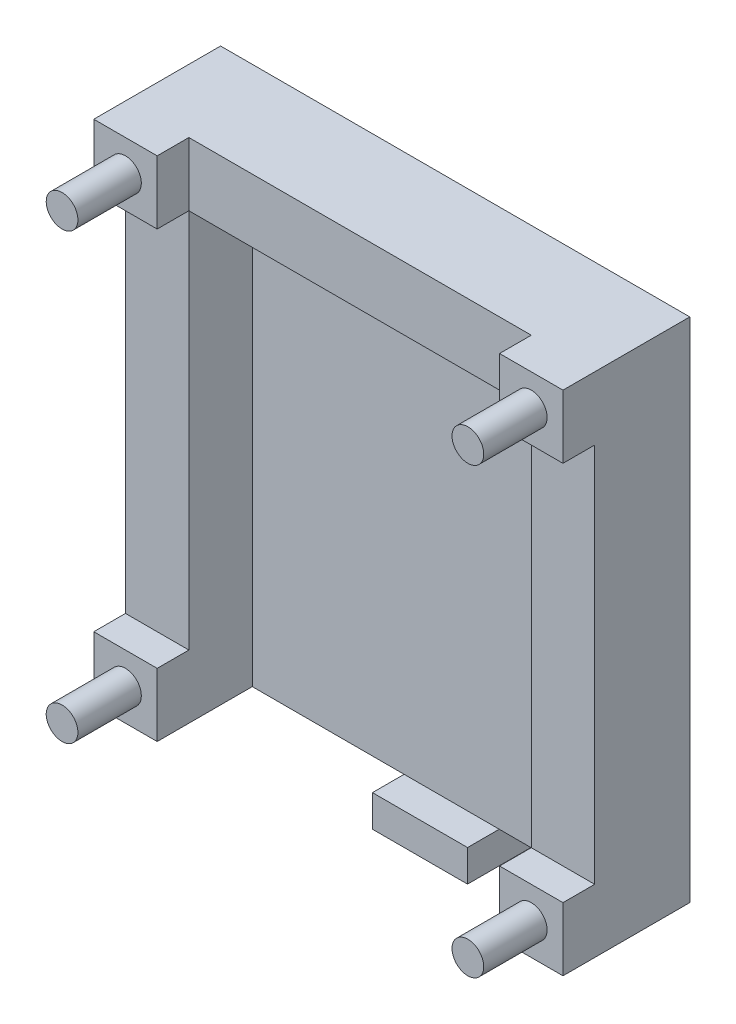
ISO-10303-21;
HEADER;
FILE_DESCRIPTION(('STEP AP214'),'2;1');
FILE_NAME('part.step','',(''),(''),'','','');
FILE_SCHEMA(('AUTOMOTIVE_DESIGN { 1 0 10303 214 1 1 1 1 }'));
ENDSEC;
DATA;
#1=APPLICATION_CONTEXT('core data for automotive mechanical design processes');
#2=APPLICATION_PROTOCOL_DEFINITION('international standard','automotive_design',2000,#1);
#3=PRODUCT_CONTEXT('',#1,'mechanical');
#4=PRODUCT('Part','Part','',(#3));
#5=PRODUCT_RELATED_PRODUCT_CATEGORY('part','',(#4));
#6=PRODUCT_DEFINITION_FORMATION('','',#4);
#7=PRODUCT_DEFINITION_CONTEXT('part definition',#1,'design');
#8=PRODUCT_DEFINITION('design','',#6,#7);
#9=PRODUCT_DEFINITION_SHAPE('','',#8);
#10=(LENGTH_UNIT() NAMED_UNIT(*) SI_UNIT(.MILLI.,.METRE.));
#11=(NAMED_UNIT(*) PLANE_ANGLE_UNIT() SI_UNIT($,.RADIAN.));
#12=(NAMED_UNIT(*) SI_UNIT($,.STERADIAN.) SOLID_ANGLE_UNIT());
#13=UNCERTAINTY_MEASURE_WITH_UNIT(LENGTH_MEASURE(1.E-05),#10,'distance_accuracy_value','');
#14=(GEOMETRIC_REPRESENTATION_CONTEXT(3) GLOBAL_UNCERTAINTY_ASSIGNED_CONTEXT((#13)) GLOBAL_UNIT_ASSIGNED_CONTEXT((#10,
#11,#12)) REPRESENTATION_CONTEXT('',''));
#15=CARTESIAN_POINT('',(0.,0.,0.));
#16=DIRECTION('',(0.,0.,1.));
#17=DIRECTION('',(1.,0.,0.));
#18=AXIS2_PLACEMENT_3D('',#15,#16,#17);
#19=CARTESIAN_POINT('',(0.,-38.4913625304137,10.));
#20=DIRECTION('',(0.,1.,0.));
#21=DIRECTION('',(-1.,0.,0.));
#22=AXIS2_PLACEMENT_3D('',#19,#20,#21);
#23=PLANE('',#22);
#24=DIRECTION('',(1.,0.,0.));
#25=VECTOR('',#24,1.);
#26=CARTESIAN_POINT('',(0.,-38.4913625304137,0.));
#27=LINE('',#26,#25);
#28=CARTESIAN_POINT('',(25.3489672837016,-38.4913625304136,0.));
#29=VERTEX_POINT('',#28);
#30=CARTESIAN_POINT('',(40.3489672837016,-38.4913625304136,0.));
#31=VERTEX_POINT('',#30);
#32=EDGE_CURVE('E110',#29,#31,#27,.T.);
#33=ORIENTED_EDGE('',*,*,#32,.T.);
#34=DIRECTION('',(0.,0.,-1.));
#35=VECTOR('',#34,1.);
#36=CARTESIAN_POINT('',(40.3489672837016,-38.4913625304136,10.));
#37=LINE('',#36,#35);
#38=CARTESIAN_POINT('',(40.3489672837016,-38.4913625304136,10.));
#39=VERTEX_POINT('',#38);
#40=EDGE_CURVE('E13',#39,#31,#37,.T.);
#41=ORIENTED_EDGE('',*,*,#40,.F.);
#42=DIRECTION('',(1.,0.,0.));
#43=VECTOR('',#42,1.);
#44=CARTESIAN_POINT('',(0.,-38.4913625304137,10.));
#45=LINE('',#44,#43);
#46=CARTESIAN_POINT('',(25.3489672837016,-38.4913625304136,10.));
#47=VERTEX_POINT('',#46);
#48=EDGE_CURVE('E105',#47,#39,#45,.T.);
#49=ORIENTED_EDGE('',*,*,#48,.F.);
#50=DIRECTION('',(0.,0.,-1.));
#51=VECTOR('',#50,1.);
#52=CARTESIAN_POINT('',(25.3489672837016,-38.4913625304136,10.));
#53=LINE('',#52,#51);
#54=EDGE_CURVE('E49',#47,#29,#53,.T.);
#55=ORIENTED_EDGE('',*,*,#54,.T.);
#56=EDGE_LOOP('',(#33,#41,#49,#55));
#57=FACE_BOUND('',#56,.T.);
#58=ADVANCED_FACE('F46',(#57),#23,.F.);
#59=CARTESIAN_POINT('',(40.3489672837016,0.,10.));
#60=DIRECTION('',(-1.,0.,0.));
#61=DIRECTION('',(0.,0.,1.));
#62=AXIS2_PLACEMENT_3D('',#59,#60,#61);
#63=PLANE('',#62);
#64=DIRECTION('',(0.,1.,0.));
#65=VECTOR('',#64,1.);
#66=CARTESIAN_POINT('',(40.3489672837016,0.,0.));
#67=LINE('',#66,#65);
#68=CARTESIAN_POINT('',(40.3489672837016,-33.4913625304136,0.));
#69=VERTEX_POINT('',#68);
#70=EDGE_CURVE('E77',#31,#69,#67,.T.);
#71=ORIENTED_EDGE('',*,*,#70,.T.);
#72=DIRECTION('',(0.,0.,-1.));
#73=VECTOR('',#72,1.);
#74=CARTESIAN_POINT('',(40.3489672837016,-33.4913625304136,10.));
#75=LINE('',#74,#73);
#76=CARTESIAN_POINT('',(40.3489672837016,-33.4913625304136,10.));
#77=VERTEX_POINT('',#76);
#78=EDGE_CURVE('E55',#77,#69,#75,.T.);
#79=ORIENTED_EDGE('',*,*,#78,.F.);
#80=DIRECTION('',(0.,1.,0.));
#81=VECTOR('',#80,1.);
#82=CARTESIAN_POINT('',(40.3489672837016,0.,10.));
#83=LINE('',#82,#81);
#84=EDGE_CURVE('E63',#39,#77,#83,.T.);
#85=ORIENTED_EDGE('',*,*,#84,.F.);
#86=ORIENTED_EDGE('',*,*,#40,.T.);
#87=EDGE_LOOP('',(#71,#79,#85,#86));
#88=FACE_BOUND('',#87,.T.);
#89=ADVANCED_FACE('F120',(#88),#63,.F.);
#90=CARTESIAN_POINT('',(0.,-33.4913625304136,10.));
#91=DIRECTION('',(0.,-1.,0.));
#92=DIRECTION('',(1.,0.,0.));
#93=AXIS2_PLACEMENT_3D('',#90,#91,#92);
#94=PLANE('',#93);
#95=DIRECTION('',(-1.,0.,0.));
#96=VECTOR('',#95,1.);
#97=CARTESIAN_POINT('',(0.,-33.4913625304136,0.));
#98=LINE('',#97,#96);
#99=CARTESIAN_POINT('',(25.3489672837016,-33.4913625304136,0.));
#100=VERTEX_POINT('',#99);
#101=EDGE_CURVE('E99',#69,#100,#98,.T.);
#102=ORIENTED_EDGE('',*,*,#101,.T.);
#103=DIRECTION('',(0.,0.,-1.));
#104=VECTOR('',#103,1.);
#105=CARTESIAN_POINT('',(25.3489672837016,-33.4913625304136,10.));
#106=LINE('',#105,#104);
#107=CARTESIAN_POINT('',(25.3489672837016,-33.4913625304136,10.));
#108=VERTEX_POINT('',#107);
#109=EDGE_CURVE('E97',#108,#100,#106,.T.);
#110=ORIENTED_EDGE('',*,*,#109,.F.);
#111=DIRECTION('',(-1.,0.,0.));
#112=VECTOR('',#111,1.);
#113=CARTESIAN_POINT('',(0.,-33.4913625304136,10.));
#114=LINE('',#113,#112);
#115=EDGE_CURVE('E91',#77,#108,#114,.T.);
#116=ORIENTED_EDGE('',*,*,#115,.F.);
#117=ORIENTED_EDGE('',*,*,#78,.T.);
#118=EDGE_LOOP('',(#102,#110,#116,#117));
#119=FACE_BOUND('',#118,.T.);
#120=ADVANCED_FACE('F98',(#119),#94,.F.);
#121=CARTESIAN_POINT('',(25.3489672837016,0.,10.));
#122=DIRECTION('',(1.,0.,0.));
#123=DIRECTION('',(0.,0.,-1.));
#124=AXIS2_PLACEMENT_3D('',#121,#122,#123);
#125=PLANE('',#124);
#126=DIRECTION('',(0.,-1.,0.));
#127=VECTOR('',#126,1.);
#128=CARTESIAN_POINT('',(25.3489672837016,0.,0.));
#129=LINE('',#128,#127);
#130=EDGE_CURVE('E113',#100,#29,#129,.T.);
#131=ORIENTED_EDGE('',*,*,#130,.T.);
#132=ORIENTED_EDGE('',*,*,#54,.F.);
#133=DIRECTION('',(0.,-1.,0.));
#134=VECTOR('',#133,1.);
#135=CARTESIAN_POINT('',(25.3489672837016,0.,10.));
#136=LINE('',#135,#134);
#137=EDGE_CURVE('E88',#108,#47,#136,.T.);
#138=ORIENTED_EDGE('',*,*,#137,.F.);
#139=ORIENTED_EDGE('',*,*,#109,.T.);
#140=EDGE_LOOP('',(#131,#132,#138,#139));
#141=FACE_BOUND('',#140,.T.);
#142=ADVANCED_FACE('F102',(#141),#125,.F.);
#143=CARTESIAN_POINT('',(0.,0.,10.));
#144=DIRECTION('',(0.,0.,-1.));
#145=DIRECTION('',(-1.,0.,0.));
#146=AXIS2_PLACEMENT_3D('',#143,#144,#145);
#147=PLANE('',#146);
#148=ORIENTED_EDGE('',*,*,#48,.T.);
#149=ORIENTED_EDGE('',*,*,#84,.T.);
#150=ORIENTED_EDGE('',*,*,#115,.T.);
#151=ORIENTED_EDGE('',*,*,#137,.T.);
#152=EDGE_LOOP('',(#148,#149,#150,#151));
#153=FACE_BOUND('',#152,.T.);
#154=ADVANCED_FACE('F93',(#153),#147,.F.);
#155=CARTESIAN_POINT('',(0.,0.,0.));
#156=DIRECTION('',(0.,0.,-1.));
#157=DIRECTION('',(-1.,0.,0.));
#158=AXIS2_PLACEMENT_3D('',#155,#156,#157);
#159=PLANE('',#158);
#160=ORIENTED_EDGE('',*,*,#32,.F.);
#161=ORIENTED_EDGE('',*,*,#130,.F.);
#162=ORIENTED_EDGE('',*,*,#101,.F.);
#163=ORIENTED_EDGE('',*,*,#70,.F.);
#164=EDGE_LOOP('',(#160,#161,#162,#163));
#165=FACE_BOUND('',#164,.T.);
#166=ADVANCED_FACE('F117',(#165),#159,.T.);
#167=CLOSED_SHELL('',(#58,#89,#120,#142,#154,#166));
#168=MANIFOLD_SOLID_BREP('B2',#167);
#169=CARTESIAN_POINT('',(0.,0.,0.));
#170=DIRECTION('',(0.,0.,-1.));
#171=DIRECTION('',(-1.,0.,0.));
#172=AXIS2_PLACEMENT_3D('',#169,#170,#171);
#173=PLANE('',#172);
#174=CARTESIAN_POINT('',(-3.59945618907709,41.5086374695864,0.));
#175=DIRECTION('',(0.,0.,-1.));
#176=DIRECTION('',(-1.,0.,0.));
#177=AXIS2_PLACEMENT_3D('',#174,#175,#176);
#178=CIRCLE('',#177,2.55);
#179=CARTESIAN_POINT('',(-6.14945618907709,41.5086374695864,0.));
#180=VERTEX_POINT('',#179);
#181=EDGE_CURVE('E562',#180,#180,#178,.F.);
#182=ORIENTED_EDGE('',*,*,#181,.T.);
#183=EDGE_LOOP('',(#182));
#184=FACE_BOUND('',#183,.T.);
#185=CARTESIAN_POINT('',(60.4005438109229,41.5086374695864,0.));
#186=DIRECTION('',(0.,0.,-1.));
#187=DIRECTION('',(-1.,0.,0.));
#188=AXIS2_PLACEMENT_3D('',#185,#186,#187);
#189=CIRCLE('',#188,2.55);
#190=CARTESIAN_POINT('',(57.8505438109229,41.5086374695864,0.));
#191=VERTEX_POINT('',#190);
#192=EDGE_CURVE('E556',#191,#191,#189,.T.);
#193=ORIENTED_EDGE('',*,*,#192,.F.);
#194=EDGE_LOOP('',(#193));
#195=FACE_BOUND('',#194,.T.);
#196=DIRECTION('',(0.,1.,0.));
#197=VECTOR('',#196,1.);
#198=CARTESIAN_POINT('',(-8.59945618907709,0.,0.));
#199=LINE('',#198,#197);
#200=CARTESIAN_POINT('',(-8.59945618907709,-33.4913625304136,0.));
#201=VERTEX_POINT('',#200);
#202=CARTESIAN_POINT('',(-8.59945618907708,46.5086374695864,0.));
#203=VERTEX_POINT('',#202);
#204=EDGE_CURVE('E334',#201,#203,#199,.T.);
#205=ORIENTED_EDGE('',*,*,#204,.T.);
#206=DIRECTION('',(1.,0.,0.));
#207=VECTOR('',#206,1.);
#208=CARTESIAN_POINT('',(55.4005438109229,46.5086374695864,0.));
#209=LINE('',#208,#207);
#210=CARTESIAN_POINT('',(65.4005438109229,46.5086374695864,0.));
#211=VERTEX_POINT('',#210);
#212=EDGE_CURVE('E397',#203,#211,#209,.T.);
#213=ORIENTED_EDGE('',*,*,#212,.T.);
#214=DIRECTION('',(0.,-1.,0.));
#215=VECTOR('',#214,1.);
#216=CARTESIAN_POINT('',(65.4005438109229,0.,0.));
#217=LINE('',#216,#215);
#218=CARTESIAN_POINT('',(65.4005438109229,-33.4913625304136,0.));
#219=VERTEX_POINT('',#218);
#220=EDGE_CURVE('E373',#211,#219,#217,.T.);
#221=ORIENTED_EDGE('',*,*,#220,.T.);
#222=DIRECTION('',(1.,0.,0.));
#223=VECTOR('',#222,1.);
#224=CARTESIAN_POINT('',(55.4005438109229,-33.4913625304136,0.));
#225=LINE('',#224,#223);
#226=EDGE_CURVE('E419',#201,#219,#225,.T.);
#227=ORIENTED_EDGE('',*,*,#226,.F.);
#228=EDGE_LOOP('',(#205,#213,#221,#227));
#229=FACE_BOUND('',#228,.T.);
#230=CARTESIAN_POINT('',(-3.59945618907709,-28.4913625304136,0.));
#231=DIRECTION('',(0.,0.,-1.));
#232=DIRECTION('',(-1.,0.,0.));
#233=AXIS2_PLACEMENT_3D('',#230,#231,#232);
#234=CIRCLE('',#233,2.55);
#235=CARTESIAN_POINT('',(-6.14945618907709,-28.4913625304136,0.));
#236=VERTEX_POINT('',#235);
#237=EDGE_CURVE('E568',#236,#236,#234,.T.);
#238=ORIENTED_EDGE('',*,*,#237,.F.);
#239=EDGE_LOOP('',(#238));
#240=FACE_BOUND('',#239,.T.);
#241=CARTESIAN_POINT('',(60.4005438109229,-28.4913625304136,0.));
#242=DIRECTION('',(0.,0.,-1.));
#243=DIRECTION('',(-1.,0.,0.));
#244=AXIS2_PLACEMENT_3D('',#241,#242,#243);
#245=CIRCLE('',#244,2.55);
#246=CARTESIAN_POINT('',(57.8505438109229,-28.4913625304136,0.));
#247=VERTEX_POINT('',#246);
#248=EDGE_CURVE('E574',#247,#247,#245,.F.);
#249=ORIENTED_EDGE('',*,*,#248,.T.);
#250=EDGE_LOOP('',(#249));
#251=FACE_BOUND('',#250,.T.);
#252=ADVANCED_FACE('F179',(#184,#195,#229,#240,#251),#173,.T.);
#253=CARTESIAN_POINT('',(0.,0.,20.));
#254=DIRECTION('',(0.,0.,-1.));
#255=DIRECTION('',(-1.,0.,0.));
#256=AXIS2_PLACEMENT_3D('',#253,#254,#255);
#257=PLANE('',#256);
#258=DIRECTION('',(-1.,0.,0.));
#259=VECTOR('',#258,1.);
#260=CARTESIAN_POINT('',(0.,-23.4913625304136,20.));
#261=LINE('',#260,#259);
#262=CARTESIAN_POINT('',(65.4005438109229,-23.4913625304136,20.));
#263=VERTEX_POINT('',#262);
#264=CARTESIAN_POINT('',(55.4005438109229,-23.4913625304136,20.));
#265=VERTEX_POINT('',#264);
#266=EDGE_CURVE('E351',#263,#265,#261,.T.);
#267=ORIENTED_EDGE('',*,*,#266,.T.);
#268=DIRECTION('',(0.,-1.,0.));
#269=VECTOR('',#268,1.);
#270=CARTESIAN_POINT('',(55.4005438109229,0.,20.));
#271=LINE('',#270,#269);
#272=CARTESIAN_POINT('',(55.4005438109229,-33.4913625304136,20.));
#273=VERTEX_POINT('',#272);
#274=EDGE_CURVE('E367',#265,#273,#271,.T.);
#275=ORIENTED_EDGE('',*,*,#274,.T.);
#276=DIRECTION('',(1.,0.,0.));
#277=VECTOR('',#276,1.);
#278=CARTESIAN_POINT('',(0.,-33.4913625304136,20.));
#279=LINE('',#278,#277);
#280=CARTESIAN_POINT('',(65.4005438109229,-33.4913625304136,20.));
#281=VERTEX_POINT('',#280);
#282=EDGE_CURVE('E365',#273,#281,#279,.T.);
#283=ORIENTED_EDGE('',*,*,#282,.T.);
#284=DIRECTION('',(0.,1.,0.));
#285=VECTOR('',#284,1.);
#286=CARTESIAN_POINT('',(65.4005438109229,0.,20.));
#287=LINE('',#286,#285);
#288=EDGE_CURVE('E363',#281,#263,#287,.T.);
#289=ORIENTED_EDGE('',*,*,#288,.T.);
#290=EDGE_LOOP('',(#267,#275,#283,#289));
#291=FACE_BOUND('',#290,.T.);
#292=CARTESIAN_POINT('',(60.4005438109229,-28.4913625304136,20.));
#293=DIRECTION('',(0.,0.,-1.));
#294=DIRECTION('',(-1.,0.,0.));
#295=AXIS2_PLACEMENT_3D('',#292,#293,#294);
#296=CIRCLE('',#295,2.5);
#297=CARTESIAN_POINT('',(57.9005438109229,-28.4913625304136,20.));
#298=VERTEX_POINT('',#297);
#299=EDGE_CURVE('E44',#298,#298,#296,.F.);
#300=ORIENTED_EDGE('',*,*,#299,.F.);
#301=EDGE_LOOP('',(#300));
#302=FACE_BOUND('',#301,.T.);
#303=ADVANCED_FACE('F527',(#291,#302),#257,.F.);
#304=CARTESIAN_POINT('',(0.,0.,20.));
#305=DIRECTION('',(0.,0.,-1.));
#306=DIRECTION('',(-1.,0.,0.));
#307=AXIS2_PLACEMENT_3D('',#304,#305,#306);
#308=PLANE('',#307);
#309=DIRECTION('',(-1.,0.,0.));
#310=VECTOR('',#309,1.);
#311=CARTESIAN_POINT('',(0.,46.5086374695864,20.));
#312=LINE('',#311,#310);
#313=CARTESIAN_POINT('',(1.40054381092291,46.5086374695864,20.));
#314=VERTEX_POINT('',#313);
#315=CARTESIAN_POINT('',(-8.59945618907708,46.5086374695864,20.));
#316=VERTEX_POINT('',#315);
#317=EDGE_CURVE('E302',#314,#316,#312,.T.);
#318=ORIENTED_EDGE('',*,*,#317,.T.);
#319=DIRECTION('',(0.,-1.,0.));
#320=VECTOR('',#319,1.);
#321=CARTESIAN_POINT('',(-8.59945618907708,0.,20.));
#322=LINE('',#321,#320);
#323=CARTESIAN_POINT('',(-8.59945618907708,36.5086374695864,20.));
#324=VERTEX_POINT('',#323);
#325=EDGE_CURVE('E318',#316,#324,#322,.T.);
#326=ORIENTED_EDGE('',*,*,#325,.T.);
#327=DIRECTION('',(1.,0.,0.));
#328=VECTOR('',#327,1.);
#329=CARTESIAN_POINT('',(0.,36.5086374695864,20.));
#330=LINE('',#329,#328);
#331=CARTESIAN_POINT('',(1.40054381092291,36.5086374695864,20.));
#332=VERTEX_POINT('',#331);
#333=EDGE_CURVE('E305',#324,#332,#330,.T.);
#334=ORIENTED_EDGE('',*,*,#333,.T.);
#335=DIRECTION('',(0.,1.,0.));
#336=VECTOR('',#335,1.);
#337=CARTESIAN_POINT('',(1.40054381092291,0.,20.));
#338=LINE('',#337,#336);
#339=EDGE_CURVE('E297',#332,#314,#338,.T.);
#340=ORIENTED_EDGE('',*,*,#339,.T.);
#341=EDGE_LOOP('',(#318,#326,#334,#340));
#342=FACE_BOUND('',#341,.T.);
#343=CARTESIAN_POINT('',(-3.59945618907709,41.5086374695864,20.));
#344=DIRECTION('',(0.,0.,-1.));
#345=DIRECTION('',(-1.,0.,0.));
#346=AXIS2_PLACEMENT_3D('',#343,#344,#345);
#347=CIRCLE('',#346,2.5);
#348=CARTESIAN_POINT('',(-6.09945618907709,41.5086374695864,20.));
#349=VERTEX_POINT('',#348);
#350=EDGE_CURVE('E187',#349,#349,#347,.F.);
#351=ORIENTED_EDGE('',*,*,#350,.F.);
#352=EDGE_LOOP('',(#351));
#353=FACE_BOUND('',#352,.T.);
#354=ADVANCED_FACE('F299',(#342,#353),#308,.F.);
#355=CARTESIAN_POINT('',(1.40054381092291,36.5086374695864,15.));
#356=DIRECTION('',(0.,-1.,0.));
#357=DIRECTION('',(0.,0.,-1.));
#358=AXIS2_PLACEMENT_3D('',#355,#356,#357);
#359=PLANE('',#358);
#360=DIRECTION('',(-1.,0.,0.));
#361=VECTOR('',#360,1.);
#362=CARTESIAN_POINT('',(1.40054381092291,36.5086374695864,15.));
#363=LINE('',#362,#361);
#364=CARTESIAN_POINT('',(55.4005438109229,36.5086374695864,15.));
#365=VERTEX_POINT('',#364);
#366=CARTESIAN_POINT('',(1.40054381092291,36.5086374695864,15.));
#367=VERTEX_POINT('',#366);
#368=EDGE_CURVE('E410',#365,#367,#363,.T.);
#369=ORIENTED_EDGE('',*,*,#368,.T.);
#370=DIRECTION('',(0.,0.,-1.));
#371=VECTOR('',#370,1.);
#372=CARTESIAN_POINT('',(1.40054381092291,36.5086374695864,15.));
#373=LINE('',#372,#371);
#374=CARTESIAN_POINT('',(1.40054381092291,36.5086374695864,5.));
#375=VERTEX_POINT('',#374);
#376=EDGE_CURVE('E440',#367,#375,#373,.T.);
#377=ORIENTED_EDGE('',*,*,#376,.T.);
#378=DIRECTION('',(-1.,0.,0.));
#379=VECTOR('',#378,1.);
#380=CARTESIAN_POINT('',(1.40054381092291,36.5086374695864,5.));
#381=LINE('',#380,#379);
#382=CARTESIAN_POINT('',(55.4005438109229,36.5086374695864,5.));
#383=VERTEX_POINT('',#382);
#384=EDGE_CURVE('E443',#383,#375,#381,.T.);
#385=ORIENTED_EDGE('',*,*,#384,.F.);
#386=DIRECTION('',(0.,0.,-1.));
#387=VECTOR('',#386,1.);
#388=CARTESIAN_POINT('',(55.4005438109229,36.5086374695864,15.));
#389=LINE('',#388,#387);
#390=EDGE_CURVE('E324',#365,#383,#389,.T.);
#391=ORIENTED_EDGE('',*,*,#390,.F.);
#392=EDGE_LOOP('',(#369,#377,#385,#391));
#393=FACE_BOUND('',#392,.T.);
#394=ADVANCED_FACE('F602',(#393),#359,.T.);
#395=DIRECTION('',(0.,0.,-1.));
#396=VECTOR('',#395,1.);
#397=CARTESIAN_POINT('',(-8.59945618907708,36.5086374695864,20.));
#398=LINE('',#397,#396);
#399=CARTESIAN_POINT('',(-8.59945618907708,36.5086374695864,15.));
#400=VERTEX_POINT('',#399);
#401=EDGE_CURVE('E335',#324,#400,#398,.T.);
#402=ORIENTED_EDGE('',*,*,#401,.T.);
#403=DIRECTION('',(-1.,0.,0.));
#404=VECTOR('',#403,1.);
#405=CARTESIAN_POINT('',(0.,36.5086374695864,15.));
#406=LINE('',#405,#404);
#407=EDGE_CURVE('E487',#367,#400,#406,.T.);
#408=ORIENTED_EDGE('',*,*,#407,.F.);
#409=DIRECTION('',(0.,0.,-1.));
#410=VECTOR('',#409,1.);
#411=CARTESIAN_POINT('',(1.40054381092291,36.5086374695864,20.));
#412=LINE('',#411,#410);
#413=EDGE_CURVE('E317',#332,#367,#412,.T.);
#414=ORIENTED_EDGE('',*,*,#413,.F.);
#415=ORIENTED_EDGE('',*,*,#333,.F.);
#416=EDGE_LOOP('',(#402,#408,#414,#415));
#417=FACE_BOUND('',#416,.T.);
#418=ADVANCED_FACE('F486',(#417),#359,.T.);
#419=CARTESIAN_POINT('',(0.,-23.4913625304136,20.));
#420=DIRECTION('',(0.,1.,0.));
#421=DIRECTION('',(-1.,0.,0.));
#422=AXIS2_PLACEMENT_3D('',#419,#420,#421);
#423=PLANE('',#422);
#424=DIRECTION('',(0.,0.,-1.));
#425=VECTOR('',#424,1.);
#426=CARTESIAN_POINT('',(1.40054381092291,-23.4913625304136,20.));
#427=LINE('',#426,#425);
#428=CARTESIAN_POINT('',(1.40054381092291,-23.4913625304136,20.));
#429=VERTEX_POINT('',#428);
#430=CARTESIAN_POINT('',(1.40054381092291,-23.4913625304136,15.));
#431=VERTEX_POINT('',#430);
#432=EDGE_CURVE('E194',#429,#431,#427,.T.);
#433=ORIENTED_EDGE('',*,*,#432,.T.);
#434=DIRECTION('',(1.,0.,0.));
#435=VECTOR('',#434,1.);
#436=CARTESIAN_POINT('',(0.,-23.4913625304136,15.));
#437=LINE('',#436,#435);
#438=CARTESIAN_POINT('',(-8.59945618907709,-23.4913625304136,15.));
#439=VERTEX_POINT('',#438);
#440=EDGE_CURVE('E198',#439,#431,#437,.T.);
#441=ORIENTED_EDGE('',*,*,#440,.F.);
#442=DIRECTION('',(0.,0.,-1.));
#443=VECTOR('',#442,1.);
#444=CARTESIAN_POINT('',(-8.59945618907709,-23.4913625304136,20.));
#445=LINE('',#444,#443);
#446=CARTESIAN_POINT('',(-8.59945618907709,-23.4913625304136,20.));
#447=VERTEX_POINT('',#446);
#448=EDGE_CURVE('E352',#447,#439,#445,.T.);
#449=ORIENTED_EDGE('',*,*,#448,.F.);
#450=DIRECTION('',(1.,0.,0.));
#451=VECTOR('',#450,1.);
#452=CARTESIAN_POINT('',(0.,-23.4913625304136,20.));
#453=LINE('',#452,#451);
#454=EDGE_CURVE('E346',#447,#429,#453,.T.);
#455=ORIENTED_EDGE('',*,*,#454,.T.);
#456=EDGE_LOOP('',(#433,#441,#449,#455));
#457=FACE_BOUND('',#456,.T.);
#458=ADVANCED_FACE('F628',(#457),#423,.T.);
#459=DIRECTION('',(0.,0.,-1.));
#460=VECTOR('',#459,1.);
#461=CARTESIAN_POINT('',(55.4005438109229,36.5086374695864,20.));
#462=LINE('',#461,#460);
#463=CARTESIAN_POINT('',(55.4005438109229,36.5086374695864,20.));
#464=VERTEX_POINT('',#463);
#465=EDGE_CURVE('E407',#464,#365,#462,.T.);
#466=ORIENTED_EDGE('',*,*,#465,.T.);
#467=DIRECTION('',(-1.,0.,0.));
#468=VECTOR('',#467,1.);
#469=CARTESIAN_POINT('',(0.,36.5086374695864,15.));
#470=LINE('',#469,#468);
#471=CARTESIAN_POINT('',(65.4005438109229,36.5086374695864,15.));
#472=VERTEX_POINT('',#471);
#473=EDGE_CURVE('E436',#472,#365,#470,.T.);
#474=ORIENTED_EDGE('',*,*,#473,.F.);
#475=DIRECTION('',(0.,0.,-1.));
#476=VECTOR('',#475,1.);
#477=CARTESIAN_POINT('',(65.4005438109229,36.5086374695864,20.));
#478=LINE('',#477,#476);
#479=CARTESIAN_POINT('',(65.4005438109229,36.5086374695864,20.));
#480=VERTEX_POINT('',#479);
#481=EDGE_CURVE('E392',#480,#472,#478,.T.);
#482=ORIENTED_EDGE('',*,*,#481,.F.);
#483=DIRECTION('',(-1.,0.,0.));
#484=VECTOR('',#483,1.);
#485=CARTESIAN_POINT('',(0.,36.5086374695864,20.));
#486=LINE('',#485,#484);
#487=EDGE_CURVE('E384',#480,#464,#486,.T.);
#488=ORIENTED_EDGE('',*,*,#487,.T.);
#489=EDGE_LOOP('',(#466,#474,#482,#488));
#490=FACE_BOUND('',#489,.T.);
#491=ADVANCED_FACE('F518',(#490),#359,.T.);
#492=CARTESIAN_POINT('',(0.,-23.4913625304136,20.));
#493=DIRECTION('',(0.,-1.,0.));
#494=DIRECTION('',(0.,0.,-1.));
#495=AXIS2_PLACEMENT_3D('',#492,#493,#494);
#496=PLANE('',#495);
#497=DIRECTION('',(1.,0.,0.));
#498=VECTOR('',#497,1.);
#499=CARTESIAN_POINT('',(0.,-23.4913625304136,15.));
#500=LINE('',#499,#498);
#501=CARTESIAN_POINT('',(55.4005438109229,-23.4913625304136,15.));
#502=VERTEX_POINT('',#501);
#503=CARTESIAN_POINT('',(65.4005438109229,-23.4913625304136,15.));
#504=VERTEX_POINT('',#503);
#505=EDGE_CURVE('E433',#502,#504,#500,.T.);
#506=ORIENTED_EDGE('',*,*,#505,.F.);
#507=DIRECTION('',(0.,0.,-1.));
#508=VECTOR('',#507,1.);
#509=CARTESIAN_POINT('',(55.4005438109229,-23.4913625304136,20.));
#510=LINE('',#509,#508);
#511=EDGE_CURVE('E370',#265,#502,#510,.T.);
#512=ORIENTED_EDGE('',*,*,#511,.F.);
#513=ORIENTED_EDGE('',*,*,#266,.F.);
#514=DIRECTION('',(0.,0.,-1.));
#515=VECTOR('',#514,1.);
#516=CARTESIAN_POINT('',(65.4005438109229,-23.4913625304136,20.));
#517=LINE('',#516,#515);
#518=EDGE_CURVE('E369',#263,#504,#517,.T.);
#519=ORIENTED_EDGE('',*,*,#518,.T.);
#520=EDGE_LOOP('',(#506,#512,#513,#519));
#521=FACE_BOUND('',#520,.T.);
#522=ADVANCED_FACE('F525',(#521),#496,.F.);
#523=CARTESIAN_POINT('',(55.4005438109229,-33.4913625304136,5.));
#524=DIRECTION('',(0.,1.,0.));
#525=DIRECTION('',(-1.,0.,0.));
#526=AXIS2_PLACEMENT_3D('',#523,#524,#525);
#527=PLANE('',#526);
#528=ORIENTED_EDGE('',*,*,#226,.T.);
#529=DIRECTION('',(0.,0.,-1.));
#530=VECTOR('',#529,1.);
#531=CARTESIAN_POINT('',(65.4005438109229,-33.4913625304136,20.));
#532=LINE('',#531,#530);
#533=EDGE_CURVE('E377',#281,#219,#532,.T.);
#534=ORIENTED_EDGE('',*,*,#533,.F.);
#535=ORIENTED_EDGE('',*,*,#282,.F.);
#536=DIRECTION('',(0.,0.,-1.));
#537=VECTOR('',#536,1.);
#538=CARTESIAN_POINT('',(55.4005438109229,-33.4913625304136,20.));
#539=LINE('',#538,#537);
#540=CARTESIAN_POINT('',(55.4005438109229,-33.4913625304136,5.));
#541=VERTEX_POINT('',#540);
#542=EDGE_CURVE('E374',#273,#541,#539,.T.);
#543=ORIENTED_EDGE('',*,*,#542,.T.);
#544=DIRECTION('',(1.,0.,0.));
#545=VECTOR('',#544,1.);
#546=CARTESIAN_POINT('',(55.4005438109229,-33.4913625304136,5.));
#547=LINE('',#546,#545);
#548=CARTESIAN_POINT('',(1.40054381092291,-33.4913625304136,5.));
#549=VERTEX_POINT('',#548);
#550=EDGE_CURVE('E425',#549,#541,#547,.T.);
#551=ORIENTED_EDGE('',*,*,#550,.F.);
#552=DIRECTION('',(0.,0.,-1.));
#553=VECTOR('',#552,1.);
#554=CARTESIAN_POINT('',(1.40054381092291,-33.4913625304136,20.));
#555=LINE('',#554,#553);
#556=CARTESIAN_POINT('',(1.40054381092291,-33.4913625304136,20.));
#557=VERTEX_POINT('',#556);
#558=EDGE_CURVE('E348',#557,#549,#555,.T.);
#559=ORIENTED_EDGE('',*,*,#558,.F.);
#560=DIRECTION('',(-1.,0.,0.));
#561=VECTOR('',#560,1.);
#562=CARTESIAN_POINT('',(0.,-33.4913625304136,20.));
#563=LINE('',#562,#561);
#564=CARTESIAN_POINT('',(-8.59945618907709,-33.4913625304136,20.));
#565=VERTEX_POINT('',#564);
#566=EDGE_CURVE('E340',#557,#565,#563,.T.);
#567=ORIENTED_EDGE('',*,*,#566,.T.);
#568=DIRECTION('',(0.,0.,-1.));
#569=VECTOR('',#568,1.);
#570=CARTESIAN_POINT('',(-8.59945618907709,-33.4913625304136,20.));
#571=LINE('',#570,#569);
#572=EDGE_CURVE('E354',#565,#201,#571,.T.);
#573=ORIENTED_EDGE('',*,*,#572,.T.);
#574=EDGE_LOOP('',(#528,#534,#535,#543,#551,#559,#567,#573));
#575=FACE_BOUND('',#574,.T.);
#576=ADVANCED_FACE('F181',(#575),#527,.F.);
#577=CARTESIAN_POINT('',(0.,0.,5.));
#578=DIRECTION('',(0.,0.,-1.));
#579=DIRECTION('',(-1.,0.,0.));
#580=AXIS2_PLACEMENT_3D('',#577,#578,#579);
#581=PLANE('',#580);
#582=DIRECTION('',(0.,-1.,0.));
#583=VECTOR('',#582,1.);
#584=CARTESIAN_POINT('',(1.40054381092291,-33.4913625304136,5.));
#585=LINE('',#584,#583);
#586=EDGE_CURVE('E428',#375,#549,#585,.T.);
#587=ORIENTED_EDGE('',*,*,#586,.T.);
#588=ORIENTED_EDGE('',*,*,#550,.T.);
#589=DIRECTION('',(0.,1.,0.));
#590=VECTOR('',#589,1.);
#591=CARTESIAN_POINT('',(55.4005438109229,36.5086374695864,5.));
#592=LINE('',#591,#590);
#593=EDGE_CURVE('E427',#541,#383,#592,.T.);
#594=ORIENTED_EDGE('',*,*,#593,.T.);
#595=ORIENTED_EDGE('',*,*,#384,.T.);
#596=EDGE_LOOP('',(#587,#588,#594,#595));
#597=FACE_BOUND('',#596,.T.);
#598=ADVANCED_FACE('F599',(#597),#581,.F.);
#599=CARTESIAN_POINT('',(55.4005438109229,46.5086374695864,15.));
#600=DIRECTION('',(0.,1.,0.));
#601=DIRECTION('',(0.,0.,1.));
#602=AXIS2_PLACEMENT_3D('',#599,#600,#601);
#603=PLANE('',#602);
#604=ORIENTED_EDGE('',*,*,#212,.F.);
#605=DIRECTION('',(0.,0.,-1.));
#606=VECTOR('',#605,1.);
#607=CARTESIAN_POINT('',(-8.59945618907708,46.5086374695864,20.));
#608=LINE('',#607,#606);
#609=EDGE_CURVE('E323',#316,#203,#608,.T.);
#610=ORIENTED_EDGE('',*,*,#609,.F.);
#611=ORIENTED_EDGE('',*,*,#317,.F.);
#612=DIRECTION('',(0.,0.,-1.));
#613=VECTOR('',#612,1.);
#614=CARTESIAN_POINT('',(1.40054381092291,46.5086374695864,20.));
#615=LINE('',#614,#613);
#616=CARTESIAN_POINT('',(1.40054381092291,46.5086374695864,15.));
#617=VERTEX_POINT('',#616);
#618=EDGE_CURVE('E312',#314,#617,#615,.T.);
#619=ORIENTED_EDGE('',*,*,#618,.T.);
#620=DIRECTION('',(1.,0.,0.));
#621=VECTOR('',#620,1.);
#622=CARTESIAN_POINT('',(55.4005438109229,46.5086374695864,15.));
#623=LINE('',#622,#621);
#624=CARTESIAN_POINT('',(55.4005438109229,46.5086374695864,15.));
#625=VERTEX_POINT('',#624);
#626=EDGE_CURVE('E409',#617,#625,#623,.T.);
#627=ORIENTED_EDGE('',*,*,#626,.T.);
#628=DIRECTION('',(0.,0.,-1.));
#629=VECTOR('',#628,1.);
#630=CARTESIAN_POINT('',(55.4005438109229,46.5086374695864,20.));
#631=LINE('',#630,#629);
#632=CARTESIAN_POINT('',(55.4005438109229,46.5086374695864,20.));
#633=VERTEX_POINT('',#632);
#634=EDGE_CURVE('E398',#633,#625,#631,.T.);
#635=ORIENTED_EDGE('',*,*,#634,.F.);
#636=DIRECTION('',(1.,0.,0.));
#637=VECTOR('',#636,1.);
#638=CARTESIAN_POINT('',(0.,46.5086374695864,20.));
#639=LINE('',#638,#637);
#640=CARTESIAN_POINT('',(65.4005438109229,46.5086374695864,20.));
#641=VERTEX_POINT('',#640);
#642=EDGE_CURVE('E389',#633,#641,#639,.T.);
#643=ORIENTED_EDGE('',*,*,#642,.T.);
#644=DIRECTION('',(0.,0.,-1.));
#645=VECTOR('',#644,1.);
#646=CARTESIAN_POINT('',(65.4005438109229,46.5086374695864,20.));
#647=LINE('',#646,#645);
#648=EDGE_CURVE('E394',#641,#211,#647,.T.);
#649=ORIENTED_EDGE('',*,*,#648,.T.);
#650=EDGE_LOOP('',(#604,#610,#611,#619,#627,#635,#643,#649));
#651=FACE_BOUND('',#650,.T.);
#652=ADVANCED_FACE('F321',(#651),#603,.T.);
#653=CARTESIAN_POINT('',(0.,0.,15.));
#654=DIRECTION('',(0.,0.,1.));
#655=DIRECTION('',(1.,0.,0.));
#656=AXIS2_PLACEMENT_3D('',#653,#654,#655);
#657=PLANE('',#656);
#658=ORIENTED_EDGE('',*,*,#368,.F.);
#659=DIRECTION('',(0.,-1.,0.));
#660=VECTOR('',#659,1.);
#661=CARTESIAN_POINT('',(55.4005438109229,36.5086374695864,15.));
#662=LINE('',#661,#660);
#663=EDGE_CURVE('E415',#625,#365,#662,.T.);
#664=ORIENTED_EDGE('',*,*,#663,.F.);
#665=ORIENTED_EDGE('',*,*,#626,.F.);
#666=DIRECTION('',(0.,1.,0.));
#667=VECTOR('',#666,1.);
#668=CARTESIAN_POINT('',(1.40054381092291,46.5086374695864,15.));
#669=LINE('',#668,#667);
#670=EDGE_CURVE('E315',#367,#617,#669,.T.);
#671=ORIENTED_EDGE('',*,*,#670,.F.);
#672=EDGE_LOOP('',(#658,#664,#665,#671));
#673=FACE_BOUND('',#672,.T.);
#674=ADVANCED_FACE('F607',(#673),#657,.T.);
#675=CARTESIAN_POINT('',(55.4005438109229,0.,20.));
#676=DIRECTION('',(1.,0.,0.));
#677=DIRECTION('',(0.,1.,0.));
#678=AXIS2_PLACEMENT_3D('',#675,#676,#677);
#679=PLANE('',#678);
#680=ORIENTED_EDGE('',*,*,#634,.T.);
#681=ORIENTED_EDGE('',*,*,#663,.T.);
#682=ORIENTED_EDGE('',*,*,#465,.F.);
#683=DIRECTION('',(0.,-1.,0.));
#684=VECTOR('',#683,1.);
#685=CARTESIAN_POINT('',(55.4005438109229,0.,20.));
#686=LINE('',#685,#684);
#687=EDGE_CURVE('E387',#633,#464,#686,.T.);
#688=ORIENTED_EDGE('',*,*,#687,.F.);
#689=EDGE_LOOP('',(#680,#681,#682,#688));
#690=FACE_BOUND('',#689,.T.);
#691=ADVANCED_FACE('F610',(#690),#679,.F.);
#692=CARTESIAN_POINT('',(65.4005438109229,0.,20.));
#693=DIRECTION('',(1.,0.,0.));
#694=DIRECTION('',(0.,0.,-1.));
#695=AXIS2_PLACEMENT_3D('',#692,#693,#694);
#696=PLANE('',#695);
#697=ORIENTED_EDGE('',*,*,#220,.F.);
#698=ORIENTED_EDGE('',*,*,#648,.F.);
#699=DIRECTION('',(0.,-1.,0.));
#700=VECTOR('',#699,1.);
#701=CARTESIAN_POINT('',(65.4005438109229,0.,20.));
#702=LINE('',#701,#700);
#703=EDGE_CURVE('E381',#641,#480,#702,.T.);
#704=ORIENTED_EDGE('',*,*,#703,.T.);
#705=ORIENTED_EDGE('',*,*,#481,.T.);
#706=DIRECTION('',(0.,-1.,0.));
#707=VECTOR('',#706,1.);
#708=CARTESIAN_POINT('',(65.4005438109229,0.,15.));
#709=LINE('',#708,#707);
#710=EDGE_CURVE('E439',#472,#504,#709,.T.);
#711=ORIENTED_EDGE('',*,*,#710,.T.);
#712=ORIENTED_EDGE('',*,*,#518,.F.);
#713=ORIENTED_EDGE('',*,*,#288,.F.);
#714=ORIENTED_EDGE('',*,*,#533,.T.);
#715=EDGE_LOOP('',(#697,#698,#704,#705,#711,#712,#713,#714));
#716=FACE_BOUND('',#715,.T.);
#717=ADVANCED_FACE('F470',(#716),#696,.T.);
#718=CARTESIAN_POINT('',(0.,0.,20.));
#719=DIRECTION('',(0.,0.,-1.));
#720=DIRECTION('',(-1.,0.,0.));
#721=AXIS2_PLACEMENT_3D('',#718,#719,#720);
#722=PLANE('',#721);
#723=CARTESIAN_POINT('',(60.4005438109229,41.5086374695864,20.));
#724=DIRECTION('',(0.,0.,1.));
#725=DIRECTION('',(1.,0.,0.));
#726=AXIS2_PLACEMENT_3D('',#723,#724,#725);
#727=CIRCLE('',#726,2.5);
#728=CARTESIAN_POINT('',(62.9005438109229,41.5086374695864,20.));
#729=VERTEX_POINT('',#728);
#730=EDGE_CURVE('E541',#729,#729,#727,.F.);
#731=ORIENTED_EDGE('',*,*,#730,.T.);
#732=EDGE_LOOP('',(#731));
#733=FACE_BOUND('',#732,.T.);
#734=ORIENTED_EDGE('',*,*,#703,.F.);
#735=ORIENTED_EDGE('',*,*,#642,.F.);
#736=ORIENTED_EDGE('',*,*,#687,.T.);
#737=ORIENTED_EDGE('',*,*,#487,.F.);
#738=EDGE_LOOP('',(#734,#735,#736,#737));
#739=FACE_BOUND('',#738,.T.);
#740=ADVANCED_FACE('F614',(#733,#739),#722,.F.);
#741=CARTESIAN_POINT('',(55.4005438109229,0.,20.));
#742=DIRECTION('',(1.,0.,0.));
#743=DIRECTION('',(0.,1.,0.));
#744=AXIS2_PLACEMENT_3D('',#741,#742,#743);
#745=PLANE('',#744);
#746=ORIENTED_EDGE('',*,*,#511,.T.);
#747=DIRECTION('',(0.,-1.,0.));
#748=VECTOR('',#747,1.);
#749=CARTESIAN_POINT('',(55.4005438109229,0.,15.));
#750=LINE('',#749,#748);
#751=EDGE_CURVE('E327',#365,#502,#750,.T.);
#752=ORIENTED_EDGE('',*,*,#751,.F.);
#753=ORIENTED_EDGE('',*,*,#390,.T.);
#754=ORIENTED_EDGE('',*,*,#593,.F.);
#755=ORIENTED_EDGE('',*,*,#542,.F.);
#756=ORIENTED_EDGE('',*,*,#274,.F.);
#757=EDGE_LOOP('',(#746,#752,#753,#754,#755,#756));
#758=FACE_BOUND('',#757,.T.);
#759=ADVANCED_FACE('F522',(#758),#745,.F.);
#760=CARTESIAN_POINT('',(1.40054381092291,0.,20.));
#761=DIRECTION('',(-1.,0.,0.));
#762=DIRECTION('',(0.,0.,1.));
#763=AXIS2_PLACEMENT_3D('',#760,#761,#762);
#764=PLANE('',#763);
#765=ORIENTED_EDGE('',*,*,#558,.T.);
#766=ORIENTED_EDGE('',*,*,#586,.F.);
#767=ORIENTED_EDGE('',*,*,#376,.F.);
#768=DIRECTION('',(0.,1.,0.));
#769=VECTOR('',#768,1.);
#770=CARTESIAN_POINT('',(1.40054381092291,0.,15.));
#771=LINE('',#770,#769);
#772=EDGE_CURVE('E491',#431,#367,#771,.T.);
#773=ORIENTED_EDGE('',*,*,#772,.F.);
#774=ORIENTED_EDGE('',*,*,#432,.F.);
#775=DIRECTION('',(0.,1.,0.));
#776=VECTOR('',#775,1.);
#777=CARTESIAN_POINT('',(1.40054381092291,0.,20.));
#778=LINE('',#777,#776);
#779=EDGE_CURVE('E338',#557,#429,#778,.T.);
#780=ORIENTED_EDGE('',*,*,#779,.F.);
#781=EDGE_LOOP('',(#765,#766,#767,#773,#774,#780));
#782=FACE_BOUND('',#781,.T.);
#783=ADVANCED_FACE('F496',(#782),#764,.F.);
#784=CARTESIAN_POINT('',(-8.59945618907709,0.,20.));
#785=DIRECTION('',(-1.,0.,0.));
#786=DIRECTION('',(0.,0.,1.));
#787=AXIS2_PLACEMENT_3D('',#784,#785,#786);
#788=PLANE('',#787);
#789=ORIENTED_EDGE('',*,*,#204,.F.);
#790=ORIENTED_EDGE('',*,*,#572,.F.);
#791=DIRECTION('',(0.,1.,0.));
#792=VECTOR('',#791,1.);
#793=CARTESIAN_POINT('',(-8.59945618907709,0.,20.));
#794=LINE('',#793,#792);
#795=EDGE_CURVE('E343',#565,#447,#794,.T.);
#796=ORIENTED_EDGE('',*,*,#795,.T.);
#797=ORIENTED_EDGE('',*,*,#448,.T.);
#798=DIRECTION('',(0.,-1.,0.));
#799=VECTOR('',#798,1.);
#800=CARTESIAN_POINT('',(-8.59945618907709,0.,15.));
#801=LINE('',#800,#799);
#802=EDGE_CURVE('E483',#400,#439,#801,.T.);
#803=ORIENTED_EDGE('',*,*,#802,.F.);
#804=ORIENTED_EDGE('',*,*,#401,.F.);
#805=ORIENTED_EDGE('',*,*,#325,.F.);
#806=ORIENTED_EDGE('',*,*,#609,.T.);
#807=EDGE_LOOP('',(#789,#790,#796,#797,#803,#804,#805,#806));
#808=FACE_BOUND('',#807,.T.);
#809=ADVANCED_FACE('F479',(#808),#788,.T.);
#810=CARTESIAN_POINT('',(0.,0.,20.));
#811=DIRECTION('',(0.,0.,-1.));
#812=DIRECTION('',(-1.,0.,0.));
#813=AXIS2_PLACEMENT_3D('',#810,#811,#812);
#814=PLANE('',#813);
#815=CARTESIAN_POINT('',(-3.59945618907709,-28.4913625304136,20.));
#816=DIRECTION('',(0.,0.,1.));
#817=DIRECTION('',(1.,0.,0.));
#818=AXIS2_PLACEMENT_3D('',#815,#816,#817);
#819=CIRCLE('',#818,2.5);
#820=CARTESIAN_POINT('',(-1.09945618907709,-28.4913625304136,20.));
#821=VERTEX_POINT('',#820);
#822=EDGE_CURVE('E550',#821,#821,#819,.F.);
#823=ORIENTED_EDGE('',*,*,#822,.T.);
#824=EDGE_LOOP('',(#823));
#825=FACE_BOUND('',#824,.T.);
#826=ORIENTED_EDGE('',*,*,#779,.T.);
#827=ORIENTED_EDGE('',*,*,#454,.F.);
#828=ORIENTED_EDGE('',*,*,#795,.F.);
#829=ORIENTED_EDGE('',*,*,#566,.F.);
#830=EDGE_LOOP('',(#826,#827,#828,#829));
#831=FACE_BOUND('',#830,.T.);
#832=ADVANCED_FACE('F533',(#825,#831),#814,.F.);
#833=CARTESIAN_POINT('',(1.40054381092291,0.,20.));
#834=DIRECTION('',(-1.,0.,0.));
#835=DIRECTION('',(0.,0.,1.));
#836=AXIS2_PLACEMENT_3D('',#833,#834,#835);
#837=PLANE('',#836);
#838=ORIENTED_EDGE('',*,*,#670,.T.);
#839=ORIENTED_EDGE('',*,*,#618,.F.);
#840=ORIENTED_EDGE('',*,*,#339,.F.);
#841=ORIENTED_EDGE('',*,*,#413,.T.);
#842=EDGE_LOOP('',(#838,#839,#840,#841));
#843=FACE_BOUND('',#842,.T.);
#844=ADVANCED_FACE('F313',(#843),#837,.F.);
#845=CARTESIAN_POINT('',(0.,0.,15.));
#846=DIRECTION('',(0.,0.,-1.));
#847=DIRECTION('',(-1.,0.,0.));
#848=AXIS2_PLACEMENT_3D('',#845,#846,#847);
#849=PLANE('',#848);
#850=ORIENTED_EDGE('',*,*,#473,.T.);
#851=ORIENTED_EDGE('',*,*,#751,.T.);
#852=ORIENTED_EDGE('',*,*,#505,.T.);
#853=ORIENTED_EDGE('',*,*,#710,.F.);
#854=EDGE_LOOP('',(#850,#851,#852,#853));
#855=FACE_BOUND('',#854,.T.);
#856=ADVANCED_FACE('F508',(#855),#849,.F.);
#857=CARTESIAN_POINT('',(0.,0.,15.));
#858=DIRECTION('',(0.,0.,-1.));
#859=DIRECTION('',(-1.,0.,0.));
#860=AXIS2_PLACEMENT_3D('',#857,#858,#859);
#861=PLANE('',#860);
#862=ORIENTED_EDGE('',*,*,#802,.T.);
#863=ORIENTED_EDGE('',*,*,#440,.T.);
#864=ORIENTED_EDGE('',*,*,#772,.T.);
#865=ORIENTED_EDGE('',*,*,#407,.T.);
#866=EDGE_LOOP('',(#862,#863,#864,#865));
#867=FACE_BOUND('',#866,.T.);
#868=ADVANCED_FACE('F493',(#867),#861,.F.);
#869=CARTESIAN_POINT('',(-3.59945618907709,41.5086374695864,30.));
#870=DIRECTION('',(0.,0.,-1.));
#871=DIRECTION('',(-1.,0.,0.));
#872=AXIS2_PLACEMENT_3D('',#869,#870,#871);
#873=CYLINDRICAL_SURFACE('',#872,2.5);
#874=CARTESIAN_POINT('',(-3.59945618907709,41.5086374695864,30.));
#875=DIRECTION('',(0.,0.,1.));
#876=DIRECTION('',(1.,0.,0.));
#877=AXIS2_PLACEMENT_3D('',#874,#875,#876);
#878=CIRCLE('',#877,2.5);
#879=CARTESIAN_POINT('',(-1.09945618907709,41.5086374695864,30.));
#880=VERTEX_POINT('',#879);
#881=EDGE_CURVE('E534',#880,#880,#878,.T.);
#882=ORIENTED_EDGE('',*,*,#881,.F.);
#883=EDGE_LOOP('',(#882));
#884=FACE_BOUND('',#883,.T.);
#885=ORIENTED_EDGE('',*,*,#350,.T.);
#886=EDGE_LOOP('',(#885));
#887=FACE_BOUND('',#886,.T.);
#888=ADVANCED_FACE('F642',(#884,#887),#873,.T.);
#889=CARTESIAN_POINT('',(0.,0.,30.));
#890=DIRECTION('',(0.,0.,1.));
#891=DIRECTION('',(1.,0.,0.));
#892=AXIS2_PLACEMENT_3D('',#889,#890,#891);
#893=PLANE('',#892);
#894=ORIENTED_EDGE('',*,*,#881,.T.);
#895=EDGE_LOOP('',(#894));
#896=FACE_BOUND('',#895,.T.);
#897=ADVANCED_FACE('F645',(#896),#893,.T.);
#898=CARTESIAN_POINT('',(60.4005438109229,41.5086374695864,30.));
#899=DIRECTION('',(0.,0.,-1.));
#900=DIRECTION('',(-1.,0.,0.));
#901=AXIS2_PLACEMENT_3D('',#898,#899,#900);
#902=CYLINDRICAL_SURFACE('',#901,2.5);
#903=CARTESIAN_POINT('',(60.4005438109229,41.5086374695864,30.));
#904=DIRECTION('',(0.,0.,1.));
#905=DIRECTION('',(1.,0.,0.));
#906=AXIS2_PLACEMENT_3D('',#903,#904,#905);
#907=CIRCLE('',#906,2.5);
#908=CARTESIAN_POINT('',(62.9005438109229,41.5086374695864,30.));
#909=VERTEX_POINT('',#908);
#910=EDGE_CURVE('E538',#909,#909,#907,.F.);
#911=ORIENTED_EDGE('',*,*,#910,.T.);
#912=EDGE_LOOP('',(#911));
#913=FACE_BOUND('',#912,.T.);
#914=ORIENTED_EDGE('',*,*,#730,.F.);
#915=EDGE_LOOP('',(#914));
#916=FACE_BOUND('',#915,.T.);
#917=ADVANCED_FACE('F649',(#913,#916),#902,.T.);
#918=CARTESIAN_POINT('',(0.,0.,30.));
#919=DIRECTION('',(0.,0.,1.));
#920=DIRECTION('',(1.,0.,0.));
#921=AXIS2_PLACEMENT_3D('',#918,#919,#920);
#922=PLANE('',#921);
#923=ORIENTED_EDGE('',*,*,#910,.F.);
#924=EDGE_LOOP('',(#923));
#925=FACE_BOUND('',#924,.T.);
#926=ADVANCED_FACE('F653',(#925),#922,.T.);
#927=CARTESIAN_POINT('',(60.4005438109229,-28.4913625304136,30.));
#928=DIRECTION('',(0.,0.,-1.));
#929=DIRECTION('',(-1.,0.,0.));
#930=AXIS2_PLACEMENT_3D('',#927,#928,#929);
#931=CYLINDRICAL_SURFACE('',#930,2.5);
#932=CARTESIAN_POINT('',(60.4005438109229,-28.4913625304136,30.));
#933=DIRECTION('',(0.,0.,1.));
#934=DIRECTION('',(1.,0.,0.));
#935=AXIS2_PLACEMENT_3D('',#932,#933,#934);
#936=CIRCLE('',#935,2.5);
#937=CARTESIAN_POINT('',(62.9005438109229,-28.4913625304136,30.));
#938=VERTEX_POINT('',#937);
#939=EDGE_CURVE('E544',#938,#938,#936,.T.);
#940=ORIENTED_EDGE('',*,*,#939,.F.);
#941=EDGE_LOOP('',(#940));
#942=FACE_BOUND('',#941,.T.);
#943=ORIENTED_EDGE('',*,*,#299,.T.);
#944=EDGE_LOOP('',(#943));
#945=FACE_BOUND('',#944,.T.);
#946=ADVANCED_FACE('F657',(#942,#945),#931,.T.);
#947=CARTESIAN_POINT('',(0.,0.,30.));
#948=DIRECTION('',(0.,0.,1.));
#949=DIRECTION('',(1.,0.,0.));
#950=AXIS2_PLACEMENT_3D('',#947,#948,#949);
#951=PLANE('',#950);
#952=ORIENTED_EDGE('',*,*,#939,.T.);
#953=EDGE_LOOP('',(#952));
#954=FACE_BOUND('',#953,.T.);
#955=ADVANCED_FACE('F661',(#954),#951,.T.);
#956=CARTESIAN_POINT('',(-3.59945618907709,-28.4913625304136,30.));
#957=DIRECTION('',(0.,0.,-1.));
#958=DIRECTION('',(-1.,0.,0.));
#959=AXIS2_PLACEMENT_3D('',#956,#957,#958);
#960=CYLINDRICAL_SURFACE('',#959,2.5);
#961=CARTESIAN_POINT('',(-3.59945618907709,-28.4913625304136,30.));
#962=DIRECTION('',(0.,0.,1.));
#963=DIRECTION('',(1.,0.,0.));
#964=AXIS2_PLACEMENT_3D('',#961,#962,#963);
#965=CIRCLE('',#964,2.5);
#966=CARTESIAN_POINT('',(-1.09945618907709,-28.4913625304136,30.));
#967=VERTEX_POINT('',#966);
#968=EDGE_CURVE('E549',#967,#967,#965,.F.);
#969=ORIENTED_EDGE('',*,*,#968,.T.);
#970=EDGE_LOOP('',(#969));
#971=FACE_BOUND('',#970,.T.);
#972=ORIENTED_EDGE('',*,*,#822,.F.);
#973=EDGE_LOOP('',(#972));
#974=FACE_BOUND('',#973,.T.);
#975=ADVANCED_FACE('F665',(#971,#974),#960,.T.);
#976=CARTESIAN_POINT('',(0.,0.,30.));
#977=DIRECTION('',(0.,0.,1.));
#978=DIRECTION('',(1.,0.,0.));
#979=AXIS2_PLACEMENT_3D('',#976,#977,#978);
#980=PLANE('',#979);
#981=ORIENTED_EDGE('',*,*,#968,.F.);
#982=EDGE_LOOP('',(#981));
#983=FACE_BOUND('',#982,.T.);
#984=ADVANCED_FACE('F669',(#983),#980,.T.);
#985=CARTESIAN_POINT('',(60.4005438109229,41.5086374695864,10.));
#986=DIRECTION('',(0.,0.,-1.));
#987=DIRECTION('',(-1.,0.,0.));
#988=AXIS2_PLACEMENT_3D('',#985,#986,#987);
#989=CYLINDRICAL_SURFACE('',#988,2.55);
#990=CARTESIAN_POINT('',(60.4005438109229,41.5086374695864,10.));
#991=DIRECTION('',(0.,0.,-1.));
#992=DIRECTION('',(-1.,0.,0.));
#993=AXIS2_PLACEMENT_3D('',#990,#991,#992);
#994=CIRCLE('',#993,2.55);
#995=CARTESIAN_POINT('',(57.8505438109229,41.5086374695864,10.));
#996=VERTEX_POINT('',#995);
#997=EDGE_CURVE('E553',#996,#996,#994,.T.);
#998=ORIENTED_EDGE('',*,*,#997,.F.);
#999=EDGE_LOOP('',(#998));
#1000=FACE_BOUND('',#999,.T.);
#1001=ORIENTED_EDGE('',*,*,#192,.T.);
#1002=EDGE_LOOP('',(#1001));
#1003=FACE_BOUND('',#1002,.T.);
#1004=ADVANCED_FACE('F673',(#1000,#1003),#989,.F.);
#1005=CARTESIAN_POINT('',(0.,0.,10.));
#1006=DIRECTION('',(0.,0.,-1.));
#1007=DIRECTION('',(-1.,0.,0.));
#1008=AXIS2_PLACEMENT_3D('',#1005,#1006,#1007);
#1009=PLANE('',#1008);
#1010=ORIENTED_EDGE('',*,*,#997,.T.);
#1011=EDGE_LOOP('',(#1010));
#1012=FACE_BOUND('',#1011,.T.);
#1013=ADVANCED_FACE('F677',(#1012),#1009,.T.);
#1014=CARTESIAN_POINT('',(-3.59945618907709,41.5086374695864,10.));
#1015=DIRECTION('',(0.,0.,-1.));
#1016=DIRECTION('',(-1.,0.,0.));
#1017=AXIS2_PLACEMENT_3D('',#1014,#1015,#1016);
#1018=CYLINDRICAL_SURFACE('',#1017,2.55);
#1019=CARTESIAN_POINT('',(-3.59945618907709,41.5086374695864,10.));
#1020=DIRECTION('',(0.,0.,-1.));
#1021=DIRECTION('',(-1.,0.,0.));
#1022=AXIS2_PLACEMENT_3D('',#1019,#1020,#1021);
#1023=CIRCLE('',#1022,2.55);
#1024=CARTESIAN_POINT('',(-6.14945618907709,41.5086374695864,10.));
#1025=VERTEX_POINT('',#1024);
#1026=EDGE_CURVE('E559',#1025,#1025,#1023,.F.);
#1027=ORIENTED_EDGE('',*,*,#1026,.T.);
#1028=EDGE_LOOP('',(#1027));
#1029=FACE_BOUND('',#1028,.T.);
#1030=ORIENTED_EDGE('',*,*,#181,.F.);
#1031=EDGE_LOOP('',(#1030));
#1032=FACE_BOUND('',#1031,.T.);
#1033=ADVANCED_FACE('F681',(#1029,#1032),#1018,.F.);
#1034=CARTESIAN_POINT('',(0.,0.,10.));
#1035=DIRECTION('',(0.,0.,-1.));
#1036=DIRECTION('',(-1.,0.,0.));
#1037=AXIS2_PLACEMENT_3D('',#1034,#1035,#1036);
#1038=PLANE('',#1037);
#1039=ORIENTED_EDGE('',*,*,#1026,.F.);
#1040=EDGE_LOOP('',(#1039));
#1041=FACE_BOUND('',#1040,.T.);
#1042=ADVANCED_FACE('F685',(#1041),#1038,.T.);
#1043=CARTESIAN_POINT('',(-3.59945618907709,-28.4913625304136,10.));
#1044=DIRECTION('',(0.,0.,-1.));
#1045=DIRECTION('',(-1.,0.,0.));
#1046=AXIS2_PLACEMENT_3D('',#1043,#1044,#1045);
#1047=CYLINDRICAL_SURFACE('',#1046,2.55);
#1048=CARTESIAN_POINT('',(-3.59945618907709,-28.4913625304136,10.));
#1049=DIRECTION('',(0.,0.,-1.));
#1050=DIRECTION('',(-1.,0.,0.));
#1051=AXIS2_PLACEMENT_3D('',#1048,#1049,#1050);
#1052=CIRCLE('',#1051,2.55);
#1053=CARTESIAN_POINT('',(-6.14945618907709,-28.4913625304136,10.));
#1054=VERTEX_POINT('',#1053);
#1055=EDGE_CURVE('E565',#1054,#1054,#1052,.T.);
#1056=ORIENTED_EDGE('',*,*,#1055,.F.);
#1057=EDGE_LOOP('',(#1056));
#1058=FACE_BOUND('',#1057,.T.);
#1059=ORIENTED_EDGE('',*,*,#237,.T.);
#1060=EDGE_LOOP('',(#1059));
#1061=FACE_BOUND('',#1060,.T.);
#1062=ADVANCED_FACE('F689',(#1058,#1061),#1047,.F.);
#1063=CARTESIAN_POINT('',(0.,0.,10.));
#1064=DIRECTION('',(0.,0.,-1.));
#1065=DIRECTION('',(-1.,0.,0.));
#1066=AXIS2_PLACEMENT_3D('',#1063,#1064,#1065);
#1067=PLANE('',#1066);
#1068=ORIENTED_EDGE('',*,*,#1055,.T.);
#1069=EDGE_LOOP('',(#1068));
#1070=FACE_BOUND('',#1069,.T.);
#1071=ADVANCED_FACE('F589',(#1070),#1067,.T.);
#1072=CARTESIAN_POINT('',(60.4005438109229,-28.4913625304136,10.));
#1073=DIRECTION('',(0.,0.,-1.));
#1074=DIRECTION('',(-1.,0.,0.));
#1075=AXIS2_PLACEMENT_3D('',#1072,#1073,#1074);
#1076=CYLINDRICAL_SURFACE('',#1075,2.55);
#1077=CARTESIAN_POINT('',(60.4005438109229,-28.4913625304136,10.));
#1078=DIRECTION('',(0.,0.,-1.));
#1079=DIRECTION('',(-1.,0.,0.));
#1080=AXIS2_PLACEMENT_3D('',#1077,#1078,#1079);
#1081=CIRCLE('',#1080,2.55);
#1082=CARTESIAN_POINT('',(57.8505438109229,-28.4913625304136,10.));
#1083=VERTEX_POINT('',#1082);
#1084=EDGE_CURVE('E571',#1083,#1083,#1081,.F.);
#1085=ORIENTED_EDGE('',*,*,#1084,.T.);
#1086=EDGE_LOOP('',(#1085));
#1087=FACE_BOUND('',#1086,.T.);
#1088=ORIENTED_EDGE('',*,*,#248,.F.);
#1089=EDGE_LOOP('',(#1088));
#1090=FACE_BOUND('',#1089,.T.);
#1091=ADVANCED_FACE('F580',(#1087,#1090),#1076,.F.);
#1092=CARTESIAN_POINT('',(0.,0.,10.));
#1093=DIRECTION('',(0.,0.,-1.));
#1094=DIRECTION('',(-1.,0.,0.));
#1095=AXIS2_PLACEMENT_3D('',#1092,#1093,#1094);
#1096=PLANE('',#1095);
#1097=ORIENTED_EDGE('',*,*,#1084,.F.);
#1098=EDGE_LOOP('',(#1097));
#1099=FACE_BOUND('',#1098,.T.);
#1100=ADVANCED_FACE('F583',(#1099),#1096,.T.);
#1101=CLOSED_SHELL('',(#252,#303,#354,#394,#418,#458,#491,#522,#576,#598,#652,#674,#691,#717,
#740,#759,#783,#809,#832,#844,#856,#868,#888,#897,#917,#926,#946,#955,#975,#984,#1004,#1013,
#1033,#1042,#1062,#1071,#1091,#1100));
#1102=MANIFOLD_SOLID_BREP('B7',#1101);
#1103=ADVANCED_BREP_SHAPE_REPRESENTATION('',(#18,#168,#1102),#14);
#1104=SHAPE_DEFINITION_REPRESENTATION(#9,#1103);
ENDSEC;
END-ISO-10303-21;
